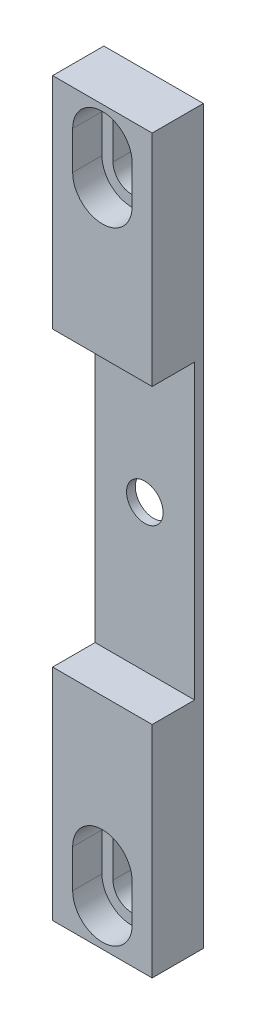
ISO-10303-21;
HEADER;
FILE_DESCRIPTION(('STEP AP214'),'2;1');
FILE_NAME('part.step','',(''),(''),'','','');
FILE_SCHEMA(('AUTOMOTIVE_DESIGN { 1 0 10303 214 1 1 1 1 }'));
ENDSEC;
DATA;
#1=APPLICATION_CONTEXT('core data for automotive mechanical design processes');
#2=APPLICATION_PROTOCOL_DEFINITION('international standard','automotive_design',2000,#1);
#3=PRODUCT_CONTEXT('',#1,'mechanical');
#4=PRODUCT('Part','Part','',(#3));
#5=PRODUCT_RELATED_PRODUCT_CATEGORY('part','',(#4));
#6=PRODUCT_DEFINITION_FORMATION('','',#4);
#7=PRODUCT_DEFINITION_CONTEXT('part definition',#1,'design');
#8=PRODUCT_DEFINITION('design','',#6,#7);
#9=PRODUCT_DEFINITION_SHAPE('','',#8);
#10=(LENGTH_UNIT() NAMED_UNIT(*) SI_UNIT(.MILLI.,.METRE.));
#11=(NAMED_UNIT(*) PLANE_ANGLE_UNIT() SI_UNIT($,.RADIAN.));
#12=(NAMED_UNIT(*) SI_UNIT($,.STERADIAN.) SOLID_ANGLE_UNIT());
#13=UNCERTAINTY_MEASURE_WITH_UNIT(LENGTH_MEASURE(1.E-05),#10,'distance_accuracy_value','');
#14=(GEOMETRIC_REPRESENTATION_CONTEXT(3) GLOBAL_UNCERTAINTY_ASSIGNED_CONTEXT((#13)) GLOBAL_UNIT_ASSIGNED_CONTEXT((#10,
#11,#12)) REPRESENTATION_CONTEXT('',''));
#15=CARTESIAN_POINT('',(0.,0.,0.));
#16=DIRECTION('',(0.,0.,1.));
#17=DIRECTION('',(1.,0.,0.));
#18=AXIS2_PLACEMENT_3D('',#15,#16,#17);
#19=CARTESIAN_POINT('',(0.,-57.277,0.));
#20=DIRECTION('',(0.,0.,1.));
#21=DIRECTION('',(1.,0.,0.));
#22=AXIS2_PLACEMENT_3D('',#19,#20,#21);
#23=CYLINDRICAL_SURFACE('',#22,3.2385);
#24=CARTESIAN_POINT('',(0.,-57.277,3.81));
#25=DIRECTION('',(0.,0.,1.));
#26=DIRECTION('',(1.,0.,0.));
#27=AXIS2_PLACEMENT_3D('',#24,#25,#26);
#28=CIRCLE('',#27,3.2385);
#29=CARTESIAN_POINT('',(3.2385,-57.277,3.81));
#30=VERTEX_POINT('',#29);
#31=CARTESIAN_POINT('',(-3.2385,-57.277,3.81));
#32=VERTEX_POINT('',#31);
#33=EDGE_CURVE('E250',#30,#32,#28,.F.);
#34=ORIENTED_EDGE('',*,*,#33,.F.);
#35=DIRECTION('',(0.,0.,1.));
#36=VECTOR('',#35,1.);
#37=CARTESIAN_POINT('',(3.2385,-57.277,0.));
#38=LINE('',#37,#36);
#39=CARTESIAN_POINT('',(3.2385,-57.277,0.));
#40=VERTEX_POINT('',#39);
#41=EDGE_CURVE('E302',#40,#30,#38,.T.);
#42=ORIENTED_EDGE('',*,*,#41,.F.);
#43=CARTESIAN_POINT('',(0.,-57.277,0.));
#44=DIRECTION('',(0.,0.,1.));
#45=DIRECTION('',(-1.,0.,0.));
#46=AXIS2_PLACEMENT_3D('',#43,#44,#45);
#47=CIRCLE('',#46,3.2385);
#48=CARTESIAN_POINT('',(-3.2385,-57.277,0.));
#49=VERTEX_POINT('',#48);
#50=EDGE_CURVE('E290',#49,#40,#47,.T.);
#51=ORIENTED_EDGE('',*,*,#50,.F.);
#52=DIRECTION('',(0.,0.,1.));
#53=VECTOR('',#52,1.);
#54=CARTESIAN_POINT('',(-3.2385,-57.277,0.));
#55=LINE('',#54,#53);
#56=EDGE_CURVE('E303',#49,#32,#55,.T.);
#57=ORIENTED_EDGE('',*,*,#56,.T.);
#58=EDGE_LOOP('',(#34,#42,#51,#57));
#59=FACE_BOUND('',#58,.T.);
#60=ADVANCED_FACE('F49',(#59),#23,.F.);
#61=CARTESIAN_POINT('',(-3.2385,-57.277,0.));
#62=DIRECTION('',(-1.,0.,0.));
#63=DIRECTION('',(0.,0.,1.));
#64=AXIS2_PLACEMENT_3D('',#61,#62,#63);
#65=PLANE('',#64);
#66=DIRECTION('',(0.,1.,0.));
#67=VECTOR('',#66,1.);
#68=CARTESIAN_POINT('',(-3.2385,-57.277,3.81));
#69=LINE('',#68,#67);
#70=CARTESIAN_POINT('',(-3.2385,-50.673,3.81));
#71=VERTEX_POINT('',#70);
#72=EDGE_CURVE('E248',#32,#71,#69,.T.);
#73=ORIENTED_EDGE('',*,*,#72,.F.);
#74=ORIENTED_EDGE('',*,*,#56,.F.);
#75=DIRECTION('',(0.,-1.,0.));
#76=VECTOR('',#75,1.);
#77=CARTESIAN_POINT('',(-3.2385,-57.277,0.));
#78=LINE('',#77,#76);
#79=CARTESIAN_POINT('',(-3.2385,-50.673,0.));
#80=VERTEX_POINT('',#79);
#81=EDGE_CURVE('E299',#80,#49,#78,.T.);
#82=ORIENTED_EDGE('',*,*,#81,.F.);
#83=DIRECTION('',(0.,0.,1.));
#84=VECTOR('',#83,1.);
#85=CARTESIAN_POINT('',(-3.2385,-50.673,0.));
#86=LINE('',#85,#84);
#87=EDGE_CURVE('E307',#80,#71,#86,.T.);
#88=ORIENTED_EDGE('',*,*,#87,.T.);
#89=EDGE_LOOP('',(#73,#74,#82,#88));
#90=FACE_BOUND('',#89,.T.);
#91=ADVANCED_FACE('F432',(#90),#65,.F.);
#92=CARTESIAN_POINT('',(0.,-50.673,0.));
#93=DIRECTION('',(0.,0.,1.));
#94=DIRECTION('',(1.,0.,0.));
#95=AXIS2_PLACEMENT_3D('',#92,#93,#94);
#96=CYLINDRICAL_SURFACE('',#95,3.2385);
#97=CARTESIAN_POINT('',(0.,-50.673,3.81));
#98=DIRECTION('',(0.,0.,1.));
#99=DIRECTION('',(1.,0.,0.));
#100=AXIS2_PLACEMENT_3D('',#97,#98,#99);
#101=CIRCLE('',#100,3.2385);
#102=CARTESIAN_POINT('',(3.2385,-50.673,3.81));
#103=VERTEX_POINT('',#102);
#104=EDGE_CURVE('E71',#71,#103,#101,.F.);
#105=ORIENTED_EDGE('',*,*,#104,.F.);
#106=ORIENTED_EDGE('',*,*,#87,.F.);
#107=CARTESIAN_POINT('',(0.,-50.673,0.));
#108=DIRECTION('',(0.,0.,1.));
#109=DIRECTION('',(-1.,0.,0.));
#110=AXIS2_PLACEMENT_3D('',#107,#108,#109);
#111=CIRCLE('',#110,3.2385);
#112=CARTESIAN_POINT('',(3.2385,-50.673,0.));
#113=VERTEX_POINT('',#112);
#114=EDGE_CURVE('E296',#113,#80,#111,.T.);
#115=ORIENTED_EDGE('',*,*,#114,.F.);
#116=DIRECTION('',(0.,0.,1.));
#117=VECTOR('',#116,1.);
#118=CARTESIAN_POINT('',(3.2385,-50.673,0.));
#119=LINE('',#118,#117);
#120=EDGE_CURVE('E310',#113,#103,#119,.T.);
#121=ORIENTED_EDGE('',*,*,#120,.T.);
#122=EDGE_LOOP('',(#105,#106,#115,#121));
#123=FACE_BOUND('',#122,.T.);
#124=ADVANCED_FACE('F438',(#123),#96,.F.);
#125=CARTESIAN_POINT('',(3.2385,-57.277,0.));
#126=DIRECTION('',(1.,0.,0.));
#127=DIRECTION('',(0.,0.,-1.));
#128=AXIS2_PLACEMENT_3D('',#125,#126,#127);
#129=PLANE('',#128);
#130=DIRECTION('',(0.,-1.,0.));
#131=VECTOR('',#130,1.);
#132=CARTESIAN_POINT('',(3.2385,-57.277,3.81));
#133=LINE('',#132,#131);
#134=EDGE_CURVE('E13',#103,#30,#133,.T.);
#135=ORIENTED_EDGE('',*,*,#134,.F.);
#136=ORIENTED_EDGE('',*,*,#120,.F.);
#137=DIRECTION('',(0.,1.,0.));
#138=VECTOR('',#137,1.);
#139=CARTESIAN_POINT('',(3.2385,-57.277,0.));
#140=LINE('',#139,#138);
#141=EDGE_CURVE('E293',#40,#113,#140,.T.);
#142=ORIENTED_EDGE('',*,*,#141,.F.);
#143=ORIENTED_EDGE('',*,*,#41,.T.);
#144=EDGE_LOOP('',(#135,#136,#142,#143));
#145=FACE_BOUND('',#144,.T.);
#146=ADVANCED_FACE('F443',(#145),#129,.F.);
#147=CARTESIAN_POINT('',(0.,57.277,0.));
#148=DIRECTION('',(0.,0.,1.));
#149=DIRECTION('',(1.,0.,0.));
#150=AXIS2_PLACEMENT_3D('',#147,#148,#149);
#151=CYLINDRICAL_SURFACE('',#150,3.23850000000001);
#152=CARTESIAN_POINT('',(0.,57.277,3.81));
#153=DIRECTION('',(0.,0.,1.));
#154=DIRECTION('',(1.,0.,0.));
#155=AXIS2_PLACEMENT_3D('',#152,#153,#154);
#156=CIRCLE('',#155,3.23850000000001);
#157=CARTESIAN_POINT('',(-3.23850000000001,57.277,3.81));
#158=VERTEX_POINT('',#157);
#159=CARTESIAN_POINT('',(3.2385,57.277,3.81));
#160=VERTEX_POINT('',#159);
#161=EDGE_CURVE('E288',#158,#160,#156,.F.);
#162=ORIENTED_EDGE('',*,*,#161,.F.);
#163=DIRECTION('',(0.,0.,1.));
#164=VECTOR('',#163,1.);
#165=CARTESIAN_POINT('',(-3.23850000000001,57.277,0.));
#166=LINE('',#165,#164);
#167=CARTESIAN_POINT('',(-3.23850000000001,57.277,0.));
#168=VERTEX_POINT('',#167);
#169=EDGE_CURVE('E326',#168,#158,#166,.T.);
#170=ORIENTED_EDGE('',*,*,#169,.F.);
#171=CARTESIAN_POINT('',(0.,57.277,0.));
#172=DIRECTION('',(0.,0.,1.));
#173=DIRECTION('',(1.,0.,0.));
#174=AXIS2_PLACEMENT_3D('',#171,#172,#173);
#175=CIRCLE('',#174,3.23850000000001);
#176=CARTESIAN_POINT('',(3.2385,57.277,0.));
#177=VERTEX_POINT('',#176);
#178=EDGE_CURVE('E306',#177,#168,#175,.T.);
#179=ORIENTED_EDGE('',*,*,#178,.F.);
#180=DIRECTION('',(0.,0.,1.));
#181=VECTOR('',#180,1.);
#182=CARTESIAN_POINT('',(3.2385,57.277,0.));
#183=LINE('',#182,#181);
#184=EDGE_CURVE('E327',#177,#160,#183,.T.);
#185=ORIENTED_EDGE('',*,*,#184,.T.);
#186=EDGE_LOOP('',(#162,#170,#179,#185));
#187=FACE_BOUND('',#186,.T.);
#188=ADVANCED_FACE('F410',(#187),#151,.F.);
#189=CARTESIAN_POINT('',(3.2385,57.277,0.));
#190=DIRECTION('',(1.,0.,0.));
#191=DIRECTION('',(0.,0.,-1.));
#192=AXIS2_PLACEMENT_3D('',#189,#190,#191);
#193=PLANE('',#192);
#194=DIRECTION('',(0.,-1.,0.));
#195=VECTOR('',#194,1.);
#196=CARTESIAN_POINT('',(3.2385,57.277,3.81));
#197=LINE('',#196,#195);
#198=CARTESIAN_POINT('',(3.23850000000001,50.673,3.81));
#199=VERTEX_POINT('',#198);
#200=EDGE_CURVE('E286',#160,#199,#197,.T.);
#201=ORIENTED_EDGE('',*,*,#200,.F.);
#202=ORIENTED_EDGE('',*,*,#184,.F.);
#203=DIRECTION('',(0.,1.,0.));
#204=VECTOR('',#203,1.);
#205=CARTESIAN_POINT('',(3.2385,57.277,0.));
#206=LINE('',#205,#204);
#207=CARTESIAN_POINT('',(3.2385,50.673,0.));
#208=VERTEX_POINT('',#207);
#209=EDGE_CURVE('E323',#208,#177,#206,.T.);
#210=ORIENTED_EDGE('',*,*,#209,.F.);
#211=DIRECTION('',(0.,0.,1.));
#212=VECTOR('',#211,1.);
#213=CARTESIAN_POINT('',(3.2385,50.673,0.));
#214=LINE('',#213,#212);
#215=EDGE_CURVE('E331',#208,#199,#214,.T.);
#216=ORIENTED_EDGE('',*,*,#215,.T.);
#217=EDGE_LOOP('',(#201,#202,#210,#216));
#218=FACE_BOUND('',#217,.T.);
#219=ADVANCED_FACE('F419',(#218),#193,.F.);
#220=CARTESIAN_POINT('',(0.,50.673,0.));
#221=DIRECTION('',(0.,0.,1.));
#222=DIRECTION('',(1.,0.,0.));
#223=AXIS2_PLACEMENT_3D('',#220,#221,#222);
#224=CYLINDRICAL_SURFACE('',#223,3.23850000000001);
#225=CARTESIAN_POINT('',(0.,50.673,3.81));
#226=DIRECTION('',(0.,0.,1.));
#227=DIRECTION('',(1.,0.,0.));
#228=AXIS2_PLACEMENT_3D('',#225,#226,#227);
#229=CIRCLE('',#228,3.23850000000001);
#230=CARTESIAN_POINT('',(-3.23850000000001,50.673,3.81));
#231=VERTEX_POINT('',#230);
#232=EDGE_CURVE('E278',#199,#231,#229,.F.);
#233=ORIENTED_EDGE('',*,*,#232,.F.);
#234=ORIENTED_EDGE('',*,*,#215,.F.);
#235=CARTESIAN_POINT('',(0.,50.673,0.));
#236=DIRECTION('',(0.,0.,1.));
#237=DIRECTION('',(1.,0.,0.));
#238=AXIS2_PLACEMENT_3D('',#235,#236,#237);
#239=CIRCLE('',#238,3.23850000000001);
#240=CARTESIAN_POINT('',(-3.23850000000001,50.673,0.));
#241=VERTEX_POINT('',#240);
#242=EDGE_CURVE('E320',#241,#208,#239,.T.);
#243=ORIENTED_EDGE('',*,*,#242,.F.);
#244=DIRECTION('',(0.,0.,1.));
#245=VECTOR('',#244,1.);
#246=CARTESIAN_POINT('',(-3.23850000000001,50.673,0.));
#247=LINE('',#246,#245);
#248=EDGE_CURVE('E334',#241,#231,#247,.T.);
#249=ORIENTED_EDGE('',*,*,#248,.T.);
#250=EDGE_LOOP('',(#233,#234,#243,#249));
#251=FACE_BOUND('',#250,.T.);
#252=ADVANCED_FACE('F421',(#251),#224,.F.);
#253=CARTESIAN_POINT('',(-3.23850000000001,57.277,0.));
#254=DIRECTION('',(-1.,0.,0.));
#255=DIRECTION('',(0.,-1.,0.));
#256=AXIS2_PLACEMENT_3D('',#253,#254,#255);
#257=PLANE('',#256);
#258=DIRECTION('',(0.,1.,0.));
#259=VECTOR('',#258,1.);
#260=CARTESIAN_POINT('',(-3.23850000000001,57.277,3.81));
#261=LINE('',#260,#259);
#262=EDGE_CURVE('E57',#231,#158,#261,.T.);
#263=ORIENTED_EDGE('',*,*,#262,.F.);
#264=ORIENTED_EDGE('',*,*,#248,.F.);
#265=DIRECTION('',(0.,-1.,0.));
#266=VECTOR('',#265,1.);
#267=CARTESIAN_POINT('',(-3.23850000000001,57.277,0.));
#268=LINE('',#267,#266);
#269=EDGE_CURVE('E317',#168,#241,#268,.T.);
#270=ORIENTED_EDGE('',*,*,#269,.F.);
#271=ORIENTED_EDGE('',*,*,#169,.T.);
#272=EDGE_LOOP('',(#263,#264,#270,#271));
#273=FACE_BOUND('',#272,.T.);
#274=ADVANCED_FACE('F413',(#273),#257,.F.);
#275=CARTESIAN_POINT('',(0.,0.,8.89));
#276=DIRECTION('',(0.,0.,-1.));
#277=DIRECTION('',(-1.,0.,0.));
#278=AXIS2_PLACEMENT_3D('',#275,#276,#277);
#279=PLANE('',#278);
#280=DIRECTION('',(0.,1.,0.));
#281=VECTOR('',#280,1.);
#282=CARTESIAN_POINT('',(5.159375,50.673,8.89));
#283=LINE('',#282,#281);
#284=CARTESIAN_POINT('',(5.159375,50.673,8.89));
#285=VERTEX_POINT('',#284);
#286=CARTESIAN_POINT('',(5.15937499999999,57.277,8.89));
#287=VERTEX_POINT('',#286);
#288=EDGE_CURVE('E268',#285,#287,#283,.T.);
#289=ORIENTED_EDGE('',*,*,#288,.F.);
#290=CARTESIAN_POINT('',(0.,50.673,8.89));
#291=DIRECTION('',(0.,0.,1.));
#292=DIRECTION('',(1.,0.,0.));
#293=AXIS2_PLACEMENT_3D('',#290,#291,#292);
#294=CIRCLE('',#293,5.159375);
#295=CARTESIAN_POINT('',(-5.159375,50.673,8.89));
#296=VERTEX_POINT('',#295);
#297=EDGE_CURVE('E252',#296,#285,#294,.T.);
#298=ORIENTED_EDGE('',*,*,#297,.F.);
#299=DIRECTION('',(0.,-1.,0.));
#300=VECTOR('',#299,1.);
#301=CARTESIAN_POINT('',(-5.159375,50.673,8.89));
#302=LINE('',#301,#300);
#303=CARTESIAN_POINT('',(-5.159375,57.277,8.89));
#304=VERTEX_POINT('',#303);
#305=EDGE_CURVE('E257',#304,#296,#302,.T.);
#306=ORIENTED_EDGE('',*,*,#305,.F.);
#307=CARTESIAN_POINT('',(0.,57.277,8.89));
#308=DIRECTION('',(0.,0.,1.));
#309=DIRECTION('',(1.,0.,0.));
#310=AXIS2_PLACEMENT_3D('',#307,#308,#309);
#311=CIRCLE('',#310,5.159375);
#312=EDGE_CURVE('E271',#287,#304,#311,.T.);
#313=ORIENTED_EDGE('',*,*,#312,.F.);
#314=EDGE_LOOP('',(#289,#298,#306,#313));
#315=FACE_BOUND('',#314,.T.);
#316=DIRECTION('',(0.,-1.,0.));
#317=VECTOR('',#316,1.);
#318=CARTESIAN_POINT('',(-8.636,-63.5,8.89));
#319=LINE('',#318,#317);
#320=CARTESIAN_POINT('',(-8.636,63.5,8.89));
#321=VERTEX_POINT('',#320);
#322=CARTESIAN_POINT('',(-8.636,25.4,8.89));
#323=VERTEX_POINT('',#322);
#324=EDGE_CURVE('E368',#321,#323,#319,.T.);
#325=ORIENTED_EDGE('',*,*,#324,.T.);
#326=DIRECTION('',(-1.,0.,0.));
#327=VECTOR('',#326,1.);
#328=CARTESIAN_POINT('',(-8.636,25.4,8.89));
#329=LINE('',#328,#327);
#330=CARTESIAN_POINT('',(8.636,25.4,8.89));
#331=VERTEX_POINT('',#330);
#332=EDGE_CURVE('E343',#331,#323,#329,.T.);
#333=ORIENTED_EDGE('',*,*,#332,.F.);
#334=DIRECTION('',(0.,1.,0.));
#335=VECTOR('',#334,1.);
#336=CARTESIAN_POINT('',(8.636,-63.5,8.89));
#337=LINE('',#336,#335);
#338=CARTESIAN_POINT('',(8.636,63.5,8.89));
#339=VERTEX_POINT('',#338);
#340=EDGE_CURVE('E374',#331,#339,#337,.T.);
#341=ORIENTED_EDGE('',*,*,#340,.T.);
#342=DIRECTION('',(-1.,0.,0.));
#343=VECTOR('',#342,1.);
#344=CARTESIAN_POINT('',(-8.636,63.5,8.89));
#345=LINE('',#344,#343);
#346=EDGE_CURVE('E378',#339,#321,#345,.T.);
#347=ORIENTED_EDGE('',*,*,#346,.T.);
#348=EDGE_LOOP('',(#325,#333,#341,#347));
#349=FACE_BOUND('',#348,.T.);
#350=ADVANCED_FACE('F428',(#315,#349),#279,.F.);
#351=CARTESIAN_POINT('',(0.,0.,8.89));
#352=DIRECTION('',(0.,0.,1.));
#353=DIRECTION('',(1.,0.,0.));
#354=AXIS2_PLACEMENT_3D('',#351,#352,#353);
#355=CYLINDRICAL_SURFACE('',#354,3.175);
#356=CARTESIAN_POINT('',(0.,0.,0.));
#357=DIRECTION('',(0.,0.,-1.));
#358=DIRECTION('',(-1.,0.,0.));
#359=AXIS2_PLACEMENT_3D('',#356,#357,#358);
#360=CIRCLE('',#359,3.175);
#361=CARTESIAN_POINT('',(-3.175,0.,0.));
#362=VERTEX_POINT('',#361);
#363=EDGE_CURVE('E364',#362,#362,#360,.T.);
#364=ORIENTED_EDGE('',*,*,#363,.T.);
#365=EDGE_LOOP('',(#364));
#366=FACE_BOUND('',#365,.T.);
#367=CARTESIAN_POINT('',(0.,0.,1.524));
#368=DIRECTION('',(0.,0.,1.));
#369=DIRECTION('',(1.,0.,0.));
#370=AXIS2_PLACEMENT_3D('',#367,#368,#369);
#371=CIRCLE('',#370,3.175);
#372=CARTESIAN_POINT('',(3.175,0.,1.524));
#373=VERTEX_POINT('',#372);
#374=EDGE_CURVE('E357',#373,#373,#371,.F.);
#375=ORIENTED_EDGE('',*,*,#374,.F.);
#376=EDGE_LOOP('',(#375));
#377=FACE_BOUND('',#376,.T.);
#378=ADVANCED_FACE('F614',(#366,#377),#355,.F.);
#379=CARTESIAN_POINT('',(-8.636,-63.5,8.89));
#380=DIRECTION('',(1.,0.,0.));
#381=DIRECTION('',(0.,0.,-1.));
#382=AXIS2_PLACEMENT_3D('',#379,#380,#381);
#383=PLANE('',#382);
#384=DIRECTION('',(0.,-1.,0.));
#385=VECTOR('',#384,1.);
#386=CARTESIAN_POINT('',(-8.636,25.4,1.524));
#387=LINE('',#386,#385);
#388=CARTESIAN_POINT('',(-8.636,25.4,1.524));
#389=VERTEX_POINT('',#388);
#390=CARTESIAN_POINT('',(-8.63599999999999,-25.4,1.524));
#391=VERTEX_POINT('',#390);
#392=EDGE_CURVE('E339',#389,#391,#387,.T.);
#393=ORIENTED_EDGE('',*,*,#392,.F.);
#394=DIRECTION('',(0.,0.,1.));
#395=VECTOR('',#394,1.);
#396=CARTESIAN_POINT('',(-8.636,25.4,1.524));
#397=LINE('',#396,#395);
#398=EDGE_CURVE('E354',#389,#323,#397,.T.);
#399=ORIENTED_EDGE('',*,*,#398,.T.);
#400=ORIENTED_EDGE('',*,*,#324,.F.);
#401=DIRECTION('',(0.,0.,-1.));
#402=VECTOR('',#401,1.);
#403=CARTESIAN_POINT('',(-8.636,63.5,8.89));
#404=LINE('',#403,#402);
#405=CARTESIAN_POINT('',(-8.636,63.5,0.));
#406=VERTEX_POINT('',#405);
#407=EDGE_CURVE('E380',#321,#406,#404,.T.);
#408=ORIENTED_EDGE('',*,*,#407,.T.);
#409=DIRECTION('',(0.,-1.,0.));
#410=VECTOR('',#409,1.);
#411=CARTESIAN_POINT('',(-8.636,-63.5,0.));
#412=LINE('',#411,#410);
#413=CARTESIAN_POINT('',(-8.636,-63.5,0.));
#414=VERTEX_POINT('',#413);
#415=EDGE_CURVE('E367',#406,#414,#412,.T.);
#416=ORIENTED_EDGE('',*,*,#415,.T.);
#417=DIRECTION('',(0.,0.,-1.));
#418=VECTOR('',#417,1.);
#419=CARTESIAN_POINT('',(-8.636,-63.5,8.89));
#420=LINE('',#419,#418);
#421=CARTESIAN_POINT('',(-8.636,-63.5,8.89));
#422=VERTEX_POINT('',#421);
#423=EDGE_CURVE('E397',#422,#414,#420,.T.);
#424=ORIENTED_EDGE('',*,*,#423,.F.);
#425=CARTESIAN_POINT('',(-8.636,-25.4,8.89));
#426=VERTEX_POINT('',#425);
#427=EDGE_CURVE('E372',#426,#422,#319,.T.);
#428=ORIENTED_EDGE('',*,*,#427,.F.);
#429=DIRECTION('',(0.,0.,1.));
#430=VECTOR('',#429,1.);
#431=CARTESIAN_POINT('',(-8.63599999999999,-25.4,1.524));
#432=LINE('',#431,#430);
#433=EDGE_CURVE('E351',#391,#426,#432,.T.);
#434=ORIENTED_EDGE('',*,*,#433,.F.);
#435=EDGE_LOOP('',(#393,#399,#400,#408,#416,#424,#428,#434));
#436=FACE_BOUND('',#435,.T.);
#437=ADVANCED_FACE('F51',(#436),#383,.F.);
#438=CARTESIAN_POINT('',(-8.636,-63.5,8.89));
#439=DIRECTION('',(0.,1.,0.));
#440=DIRECTION('',(0.,0.,1.));
#441=AXIS2_PLACEMENT_3D('',#438,#439,#440);
#442=PLANE('',#441);
#443=DIRECTION('',(1.,0.,0.));
#444=VECTOR('',#443,1.);
#445=CARTESIAN_POINT('',(-8.636,-63.5,0.));
#446=LINE('',#445,#444);
#447=CARTESIAN_POINT('',(8.636,-63.5,0.));
#448=VERTEX_POINT('',#447);
#449=EDGE_CURVE('E383',#414,#448,#446,.T.);
#450=ORIENTED_EDGE('',*,*,#449,.T.);
#451=DIRECTION('',(0.,0.,-1.));
#452=VECTOR('',#451,1.);
#453=CARTESIAN_POINT('',(8.636,-63.5,8.89));
#454=LINE('',#453,#452);
#455=CARTESIAN_POINT('',(8.636,-63.5,8.89));
#456=VERTEX_POINT('',#455);
#457=EDGE_CURVE('E394',#456,#448,#454,.T.);
#458=ORIENTED_EDGE('',*,*,#457,.F.);
#459=DIRECTION('',(1.,0.,0.));
#460=VECTOR('',#459,1.);
#461=CARTESIAN_POINT('',(-8.636,-63.5,8.89));
#462=LINE('',#461,#460);
#463=EDGE_CURVE('E371',#422,#456,#462,.T.);
#464=ORIENTED_EDGE('',*,*,#463,.F.);
#465=ORIENTED_EDGE('',*,*,#423,.T.);
#466=EDGE_LOOP('',(#450,#458,#464,#465));
#467=FACE_BOUND('',#466,.T.);
#468=ADVANCED_FACE('F656',(#467),#442,.F.);
#469=CARTESIAN_POINT('',(8.636,-63.5,8.89));
#470=DIRECTION('',(-1.,0.,0.));
#471=DIRECTION('',(0.,0.,1.));
#472=AXIS2_PLACEMENT_3D('',#469,#470,#471);
#473=PLANE('',#472);
#474=ORIENTED_EDGE('',*,*,#340,.F.);
#475=DIRECTION('',(0.,0.,1.));
#476=VECTOR('',#475,1.);
#477=CARTESIAN_POINT('',(8.636,25.4,1.524));
#478=LINE('',#477,#476);
#479=CARTESIAN_POINT('',(8.636,25.4,1.524));
#480=VERTEX_POINT('',#479);
#481=EDGE_CURVE('E358',#480,#331,#478,.T.);
#482=ORIENTED_EDGE('',*,*,#481,.F.);
#483=DIRECTION('',(0.,1.,0.));
#484=VECTOR('',#483,1.);
#485=CARTESIAN_POINT('',(8.636,25.4,1.524));
#486=LINE('',#485,#484);
#487=CARTESIAN_POINT('',(8.636,-25.4,1.524));
#488=VERTEX_POINT('',#487);
#489=EDGE_CURVE('E346',#488,#480,#486,.T.);
#490=ORIENTED_EDGE('',*,*,#489,.F.);
#491=DIRECTION('',(0.,0.,1.));
#492=VECTOR('',#491,1.);
#493=CARTESIAN_POINT('',(8.636,-25.4,1.524));
#494=LINE('',#493,#492);
#495=CARTESIAN_POINT('',(8.636,-25.4,8.89));
#496=VERTEX_POINT('',#495);
#497=EDGE_CURVE('E360',#488,#496,#494,.T.);
#498=ORIENTED_EDGE('',*,*,#497,.T.);
#499=EDGE_CURVE('E375',#456,#496,#337,.T.);
#500=ORIENTED_EDGE('',*,*,#499,.F.);
#501=ORIENTED_EDGE('',*,*,#457,.T.);
#502=DIRECTION('',(0.,1.,0.));
#503=VECTOR('',#502,1.);
#504=CARTESIAN_POINT('',(8.636,-63.5,0.));
#505=LINE('',#504,#503);
#506=CARTESIAN_POINT('',(8.636,63.5,0.));
#507=VERTEX_POINT('',#506);
#508=EDGE_CURVE('E385',#448,#507,#505,.T.);
#509=ORIENTED_EDGE('',*,*,#508,.T.);
#510=DIRECTION('',(0.,0.,-1.));
#511=VECTOR('',#510,1.);
#512=CARTESIAN_POINT('',(8.636,63.5,8.89));
#513=LINE('',#512,#511);
#514=EDGE_CURVE('E391',#339,#507,#513,.T.);
#515=ORIENTED_EDGE('',*,*,#514,.F.);
#516=EDGE_LOOP('',(#474,#482,#490,#498,#500,#501,#509,#515));
#517=FACE_BOUND('',#516,.T.);
#518=ADVANCED_FACE('F647',(#517),#473,.F.);
#519=CARTESIAN_POINT('',(-8.636,63.5,8.89));
#520=DIRECTION('',(0.,-1.,0.));
#521=DIRECTION('',(0.,0.,-1.));
#522=AXIS2_PLACEMENT_3D('',#519,#520,#521);
#523=PLANE('',#522);
#524=DIRECTION('',(-1.,0.,0.));
#525=VECTOR('',#524,1.);
#526=CARTESIAN_POINT('',(-8.636,63.5,0.));
#527=LINE('',#526,#525);
#528=EDGE_CURVE('E387',#507,#406,#527,.T.);
#529=ORIENTED_EDGE('',*,*,#528,.T.);
#530=ORIENTED_EDGE('',*,*,#407,.F.);
#531=ORIENTED_EDGE('',*,*,#346,.F.);
#532=ORIENTED_EDGE('',*,*,#514,.T.);
#533=EDGE_LOOP('',(#529,#530,#531,#532));
#534=FACE_BOUND('',#533,.T.);
#535=ADVANCED_FACE('F640',(#534),#523,.F.);
#536=DIRECTION('',(0.,-1.,0.));
#537=VECTOR('',#536,1.);
#538=CARTESIAN_POINT('',(-5.15937499999999,-50.673,8.89));
#539=LINE('',#538,#537);
#540=CARTESIAN_POINT('',(-5.15937499999999,-50.673,8.89));
#541=VERTEX_POINT('',#540);
#542=CARTESIAN_POINT('',(-5.15937499999998,-57.277,8.89));
#543=VERTEX_POINT('',#542);
#544=EDGE_CURVE('E238',#541,#543,#539,.T.);
#545=ORIENTED_EDGE('',*,*,#544,.F.);
#546=CARTESIAN_POINT('',(0.,-50.673,8.89));
#547=DIRECTION('',(0.,0.,1.));
#548=DIRECTION('',(1.,0.,0.));
#549=AXIS2_PLACEMENT_3D('',#546,#547,#548);
#550=CIRCLE('',#549,5.15937499999999);
#551=CARTESIAN_POINT('',(5.15937499999999,-50.673,8.89));
#552=VERTEX_POINT('',#551);
#553=EDGE_CURVE('E64',#552,#541,#550,.T.);
#554=ORIENTED_EDGE('',*,*,#553,.F.);
#555=DIRECTION('',(0.,1.,0.));
#556=VECTOR('',#555,1.);
#557=CARTESIAN_POINT('',(5.15937499999999,-50.673,8.89));
#558=LINE('',#557,#556);
#559=CARTESIAN_POINT('',(5.15937499999999,-57.277,8.89));
#560=VERTEX_POINT('',#559);
#561=EDGE_CURVE('E229',#560,#552,#558,.T.);
#562=ORIENTED_EDGE('',*,*,#561,.F.);
#563=CARTESIAN_POINT('',(0.,-57.277,8.89));
#564=DIRECTION('',(0.,0.,1.));
#565=DIRECTION('',(1.,0.,0.));
#566=AXIS2_PLACEMENT_3D('',#563,#564,#565);
#567=CIRCLE('',#566,5.15937499999999);
#568=EDGE_CURVE('E232',#543,#560,#567,.T.);
#569=ORIENTED_EDGE('',*,*,#568,.F.);
#570=EDGE_LOOP('',(#545,#554,#562,#569));
#571=FACE_BOUND('',#570,.T.);
#572=ORIENTED_EDGE('',*,*,#499,.T.);
#573=DIRECTION('',(1.,0.,0.));
#574=VECTOR('',#573,1.);
#575=CARTESIAN_POINT('',(-8.63599999999999,-25.4,8.89));
#576=LINE('',#575,#574);
#577=EDGE_CURVE('E330',#426,#496,#576,.T.);
#578=ORIENTED_EDGE('',*,*,#577,.F.);
#579=ORIENTED_EDGE('',*,*,#427,.T.);
#580=ORIENTED_EDGE('',*,*,#463,.T.);
#581=EDGE_LOOP('',(#572,#578,#579,#580));
#582=FACE_BOUND('',#581,.T.);
#583=ADVANCED_FACE('F617',(#571,#582),#279,.F.);
#584=CARTESIAN_POINT('',(0.,0.,0.));
#585=DIRECTION('',(0.,0.,-1.));
#586=DIRECTION('',(-1.,0.,0.));
#587=AXIS2_PLACEMENT_3D('',#584,#585,#586);
#588=PLANE('',#587);
#589=ORIENTED_EDGE('',*,*,#50,.T.);
#590=ORIENTED_EDGE('',*,*,#141,.T.);
#591=ORIENTED_EDGE('',*,*,#114,.T.);
#592=ORIENTED_EDGE('',*,*,#81,.T.);
#593=EDGE_LOOP('',(#589,#590,#591,#592));
#594=FACE_BOUND('',#593,.T.);
#595=ORIENTED_EDGE('',*,*,#178,.T.);
#596=ORIENTED_EDGE('',*,*,#269,.T.);
#597=ORIENTED_EDGE('',*,*,#242,.T.);
#598=ORIENTED_EDGE('',*,*,#209,.T.);
#599=EDGE_LOOP('',(#595,#596,#597,#598));
#600=FACE_BOUND('',#599,.T.);
#601=ORIENTED_EDGE('',*,*,#363,.F.);
#602=EDGE_LOOP('',(#601));
#603=FACE_BOUND('',#602,.T.);
#604=ORIENTED_EDGE('',*,*,#415,.F.);
#605=ORIENTED_EDGE('',*,*,#528,.F.);
#606=ORIENTED_EDGE('',*,*,#508,.F.);
#607=ORIENTED_EDGE('',*,*,#449,.F.);
#608=EDGE_LOOP('',(#604,#605,#606,#607));
#609=FACE_BOUND('',#608,.T.);
#610=ADVANCED_FACE('F415',(#594,#600,#603,#609),#588,.T.);
#611=CARTESIAN_POINT('',(0.,0.,1.524));
#612=DIRECTION('',(0.,0.,1.));
#613=DIRECTION('',(1.,0.,0.));
#614=AXIS2_PLACEMENT_3D('',#611,#612,#613);
#615=PLANE('',#614);
#616=ORIENTED_EDGE('',*,*,#392,.T.);
#617=DIRECTION('',(1.,0.,0.));
#618=VECTOR('',#617,1.);
#619=CARTESIAN_POINT('',(-8.63599999999999,-25.4,1.524));
#620=LINE('',#619,#618);
#621=EDGE_CURVE('E342',#391,#488,#620,.T.);
#622=ORIENTED_EDGE('',*,*,#621,.T.);
#623=ORIENTED_EDGE('',*,*,#489,.T.);
#624=DIRECTION('',(-1.,0.,0.));
#625=VECTOR('',#624,1.);
#626=CARTESIAN_POINT('',(-8.636,25.4,1.524));
#627=LINE('',#626,#625);
#628=EDGE_CURVE('E348',#480,#389,#627,.T.);
#629=ORIENTED_EDGE('',*,*,#628,.T.);
#630=EDGE_LOOP('',(#616,#622,#623,#629));
#631=FACE_BOUND('',#630,.T.);
#632=ORIENTED_EDGE('',*,*,#374,.T.);
#633=EDGE_LOOP('',(#632));
#634=FACE_BOUND('',#633,.T.);
#635=ADVANCED_FACE('F597',(#631,#634),#615,.T.);
#636=CARTESIAN_POINT('',(-8.636,25.4,1.524));
#637=DIRECTION('',(0.,1.,0.));
#638=DIRECTION('',(0.,0.,1.));
#639=AXIS2_PLACEMENT_3D('',#636,#637,#638);
#640=PLANE('',#639);
#641=ORIENTED_EDGE('',*,*,#332,.T.);
#642=ORIENTED_EDGE('',*,*,#398,.F.);
#643=ORIENTED_EDGE('',*,*,#628,.F.);
#644=ORIENTED_EDGE('',*,*,#481,.T.);
#645=EDGE_LOOP('',(#641,#642,#643,#644));
#646=FACE_BOUND('',#645,.T.);
#647=ADVANCED_FACE('F588',(#646),#640,.F.);
#648=CARTESIAN_POINT('',(-8.63599999999999,-25.4,1.524));
#649=DIRECTION('',(0.,-1.,0.));
#650=DIRECTION('',(0.,0.,-1.));
#651=AXIS2_PLACEMENT_3D('',#648,#649,#650);
#652=PLANE('',#651);
#653=ORIENTED_EDGE('',*,*,#577,.T.);
#654=ORIENTED_EDGE('',*,*,#497,.F.);
#655=ORIENTED_EDGE('',*,*,#621,.F.);
#656=ORIENTED_EDGE('',*,*,#433,.T.);
#657=EDGE_LOOP('',(#653,#654,#655,#656));
#658=FACE_BOUND('',#657,.T.);
#659=ADVANCED_FACE('F468',(#658),#652,.F.);
#660=CARTESIAN_POINT('',(0.,50.673,3.81));
#661=DIRECTION('',(0.,0.,1.));
#662=DIRECTION('',(1.,0.,0.));
#663=AXIS2_PLACEMENT_3D('',#660,#661,#662);
#664=PLANE('',#663);
#665=CARTESIAN_POINT('',(0.,50.673,3.81));
#666=DIRECTION('',(0.,0.,1.));
#667=DIRECTION('',(1.,0.,0.));
#668=AXIS2_PLACEMENT_3D('',#665,#666,#667);
#669=CIRCLE('',#668,5.159375);
#670=CARTESIAN_POINT('',(-5.159375,50.673,3.81));
#671=VERTEX_POINT('',#670);
#672=CARTESIAN_POINT('',(5.159375,50.673,3.81));
#673=VERTEX_POINT('',#672);
#674=EDGE_CURVE('E253',#671,#673,#669,.T.);
#675=ORIENTED_EDGE('',*,*,#674,.T.);
#676=DIRECTION('',(0.,1.,0.));
#677=VECTOR('',#676,1.);
#678=CARTESIAN_POINT('',(5.159375,50.673,3.81));
#679=LINE('',#678,#677);
#680=CARTESIAN_POINT('',(5.15937499999999,57.277,3.81));
#681=VERTEX_POINT('',#680);
#682=EDGE_CURVE('E256',#673,#681,#679,.T.);
#683=ORIENTED_EDGE('',*,*,#682,.T.);
#684=CARTESIAN_POINT('',(0.,57.277,3.81));
#685=DIRECTION('',(0.,0.,1.));
#686=DIRECTION('',(1.,0.,0.));
#687=AXIS2_PLACEMENT_3D('',#684,#685,#686);
#688=CIRCLE('',#687,5.159375);
#689=CARTESIAN_POINT('',(-5.159375,57.277,3.81));
#690=VERTEX_POINT('',#689);
#691=EDGE_CURVE('E260',#681,#690,#688,.T.);
#692=ORIENTED_EDGE('',*,*,#691,.T.);
#693=DIRECTION('',(0.,-1.,0.));
#694=VECTOR('',#693,1.);
#695=CARTESIAN_POINT('',(-5.159375,50.673,3.81));
#696=LINE('',#695,#694);
#697=EDGE_CURVE('E263',#690,#671,#696,.T.);
#698=ORIENTED_EDGE('',*,*,#697,.T.);
#699=EDGE_LOOP('',(#675,#683,#692,#698));
#700=FACE_BOUND('',#699,.T.);
#701=ORIENTED_EDGE('',*,*,#161,.T.);
#702=ORIENTED_EDGE('',*,*,#200,.T.);
#703=ORIENTED_EDGE('',*,*,#232,.T.);
#704=ORIENTED_EDGE('',*,*,#262,.T.);
#705=EDGE_LOOP('',(#701,#702,#703,#704));
#706=FACE_BOUND('',#705,.T.);
#707=ADVANCED_FACE('F404',(#700,#706),#664,.T.);
#708=CARTESIAN_POINT('',(0.,50.673,3.81));
#709=DIRECTION('',(0.,0.,1.));
#710=DIRECTION('',(1.,0.,0.));
#711=AXIS2_PLACEMENT_3D('',#708,#709,#710);
#712=CYLINDRICAL_SURFACE('',#711,5.159375);
#713=ORIENTED_EDGE('',*,*,#297,.T.);
#714=DIRECTION('',(0.,0.,1.));
#715=VECTOR('',#714,1.);
#716=CARTESIAN_POINT('',(5.159375,50.673,3.81));
#717=LINE('',#716,#715);
#718=EDGE_CURVE('E266',#673,#285,#717,.T.);
#719=ORIENTED_EDGE('',*,*,#718,.F.);
#720=ORIENTED_EDGE('',*,*,#674,.F.);
#721=DIRECTION('',(0.,0.,1.));
#722=VECTOR('',#721,1.);
#723=CARTESIAN_POINT('',(-5.159375,50.673,3.81));
#724=LINE('',#723,#722);
#725=EDGE_CURVE('E276',#671,#296,#724,.T.);
#726=ORIENTED_EDGE('',*,*,#725,.T.);
#727=EDGE_LOOP('',(#713,#719,#720,#726));
#728=FACE_BOUND('',#727,.T.);
#729=ADVANCED_FACE('F450',(#728),#712,.F.);
#730=CARTESIAN_POINT('',(-5.159375,50.673,3.81));
#731=DIRECTION('',(-1.,0.,0.));
#732=DIRECTION('',(0.,-1.,0.));
#733=AXIS2_PLACEMENT_3D('',#730,#731,#732);
#734=PLANE('',#733);
#735=ORIENTED_EDGE('',*,*,#305,.T.);
#736=ORIENTED_EDGE('',*,*,#725,.F.);
#737=ORIENTED_EDGE('',*,*,#697,.F.);
#738=DIRECTION('',(0.,0.,1.));
#739=VECTOR('',#738,1.);
#740=CARTESIAN_POINT('',(-5.159375,57.277,3.81));
#741=LINE('',#740,#739);
#742=EDGE_CURVE('E279',#690,#304,#741,.T.);
#743=ORIENTED_EDGE('',*,*,#742,.T.);
#744=EDGE_LOOP('',(#735,#736,#737,#743));
#745=FACE_BOUND('',#744,.T.);
#746=ADVANCED_FACE('F453',(#745),#734,.F.);
#747=CARTESIAN_POINT('',(0.,57.277,3.81));
#748=DIRECTION('',(0.,0.,1.));
#749=DIRECTION('',(1.,0.,0.));
#750=AXIS2_PLACEMENT_3D('',#747,#748,#749);
#751=CYLINDRICAL_SURFACE('',#750,5.159375);
#752=ORIENTED_EDGE('',*,*,#312,.T.);
#753=ORIENTED_EDGE('',*,*,#742,.F.);
#754=ORIENTED_EDGE('',*,*,#691,.F.);
#755=DIRECTION('',(0.,0.,1.));
#756=VECTOR('',#755,1.);
#757=CARTESIAN_POINT('',(5.15937499999999,57.277,3.81));
#758=LINE('',#757,#756);
#759=EDGE_CURVE('E281',#681,#287,#758,.T.);
#760=ORIENTED_EDGE('',*,*,#759,.T.);
#761=EDGE_LOOP('',(#752,#753,#754,#760));
#762=FACE_BOUND('',#761,.T.);
#763=ADVANCED_FACE('F458',(#762),#751,.F.);
#764=CARTESIAN_POINT('',(5.159375,50.673,3.81));
#765=DIRECTION('',(1.,0.,0.));
#766=DIRECTION('',(0.,1.,0.));
#767=AXIS2_PLACEMENT_3D('',#764,#765,#766);
#768=PLANE('',#767);
#769=ORIENTED_EDGE('',*,*,#288,.T.);
#770=ORIENTED_EDGE('',*,*,#759,.F.);
#771=ORIENTED_EDGE('',*,*,#682,.F.);
#772=ORIENTED_EDGE('',*,*,#718,.T.);
#773=EDGE_LOOP('',(#769,#770,#771,#772));
#774=FACE_BOUND('',#773,.T.);
#775=ADVANCED_FACE('F455',(#774),#768,.F.);
#776=CARTESIAN_POINT('',(0.,-50.673,3.81));
#777=DIRECTION('',(0.,0.,1.));
#778=DIRECTION('',(1.,0.,0.));
#779=AXIS2_PLACEMENT_3D('',#776,#777,#778);
#780=PLANE('',#779);
#781=CARTESIAN_POINT('',(0.,-50.673,3.81));
#782=DIRECTION('',(0.,0.,1.));
#783=DIRECTION('',(1.,0.,0.));
#784=AXIS2_PLACEMENT_3D('',#781,#782,#783);
#785=CIRCLE('',#784,5.15937499999999);
#786=CARTESIAN_POINT('',(5.15937499999999,-50.673,3.81));
#787=VERTEX_POINT('',#786);
#788=CARTESIAN_POINT('',(-5.15937499999999,-50.673,3.81));
#789=VERTEX_POINT('',#788);
#790=EDGE_CURVE('E211',#787,#789,#785,.T.);
#791=ORIENTED_EDGE('',*,*,#790,.T.);
#792=DIRECTION('',(0.,-1.,0.));
#793=VECTOR('',#792,1.);
#794=CARTESIAN_POINT('',(-5.15937499999999,-50.673,3.81));
#795=LINE('',#794,#793);
#796=CARTESIAN_POINT('',(-5.15937499999998,-57.277,3.81));
#797=VERTEX_POINT('',#796);
#798=EDGE_CURVE('E220',#789,#797,#795,.T.);
#799=ORIENTED_EDGE('',*,*,#798,.T.);
#800=CARTESIAN_POINT('',(0.,-57.277,3.81));
#801=DIRECTION('',(0.,0.,1.));
#802=DIRECTION('',(1.,0.,0.));
#803=AXIS2_PLACEMENT_3D('',#800,#801,#802);
#804=CIRCLE('',#803,5.15937499999999);
#805=CARTESIAN_POINT('',(5.15937499999999,-57.277,3.81));
#806=VERTEX_POINT('',#805);
#807=EDGE_CURVE('E225',#797,#806,#804,.T.);
#808=ORIENTED_EDGE('',*,*,#807,.T.);
#809=DIRECTION('',(0.,1.,0.));
#810=VECTOR('',#809,1.);
#811=CARTESIAN_POINT('',(5.15937499999999,-50.673,3.81));
#812=LINE('',#811,#810);
#813=EDGE_CURVE('E217',#806,#787,#812,.T.);
#814=ORIENTED_EDGE('',*,*,#813,.T.);
#815=EDGE_LOOP('',(#791,#799,#808,#814));
#816=FACE_BOUND('',#815,.T.);
#817=ORIENTED_EDGE('',*,*,#33,.T.);
#818=ORIENTED_EDGE('',*,*,#72,.T.);
#819=ORIENTED_EDGE('',*,*,#104,.T.);
#820=ORIENTED_EDGE('',*,*,#134,.T.);
#821=EDGE_LOOP('',(#817,#818,#819,#820));
#822=FACE_BOUND('',#821,.T.);
#823=ADVANCED_FACE('F227',(#816,#822),#780,.T.);
#824=CARTESIAN_POINT('',(0.,-50.673,3.81));
#825=DIRECTION('',(0.,0.,1.));
#826=DIRECTION('',(1.,0.,0.));
#827=AXIS2_PLACEMENT_3D('',#824,#825,#826);
#828=CYLINDRICAL_SURFACE('',#827,5.15937499999999);
#829=ORIENTED_EDGE('',*,*,#553,.T.);
#830=DIRECTION('',(0.,0.,1.));
#831=VECTOR('',#830,1.);
#832=CARTESIAN_POINT('',(-5.15937499999999,-50.673,3.81));
#833=LINE('',#832,#831);
#834=EDGE_CURVE('E207',#789,#541,#833,.T.);
#835=ORIENTED_EDGE('',*,*,#834,.F.);
#836=ORIENTED_EDGE('',*,*,#790,.F.);
#837=DIRECTION('',(0.,0.,1.));
#838=VECTOR('',#837,1.);
#839=CARTESIAN_POINT('',(5.15937499999999,-50.673,3.81));
#840=LINE('',#839,#838);
#841=EDGE_CURVE('E242',#787,#552,#840,.T.);
#842=ORIENTED_EDGE('',*,*,#841,.T.);
#843=EDGE_LOOP('',(#829,#835,#836,#842));
#844=FACE_BOUND('',#843,.T.);
#845=ADVANCED_FACE('F209',(#844),#828,.F.);
#846=CARTESIAN_POINT('',(5.15937499999999,-50.673,3.81));
#847=DIRECTION('',(1.,0.,0.));
#848=DIRECTION('',(0.,1.,0.));
#849=AXIS2_PLACEMENT_3D('',#846,#847,#848);
#850=PLANE('',#849);
#851=ORIENTED_EDGE('',*,*,#561,.T.);
#852=ORIENTED_EDGE('',*,*,#841,.F.);
#853=ORIENTED_EDGE('',*,*,#813,.F.);
#854=DIRECTION('',(0.,0.,1.));
#855=VECTOR('',#854,1.);
#856=CARTESIAN_POINT('',(5.15937499999999,-57.277,3.81));
#857=LINE('',#856,#855);
#858=EDGE_CURVE('E244',#806,#560,#857,.T.);
#859=ORIENTED_EDGE('',*,*,#858,.T.);
#860=EDGE_LOOP('',(#851,#852,#853,#859));
#861=FACE_BOUND('',#860,.T.);
#862=ADVANCED_FACE('F472',(#861),#850,.F.);
#863=CARTESIAN_POINT('',(0.,-57.277,3.81));
#864=DIRECTION('',(0.,0.,1.));
#865=DIRECTION('',(1.,0.,0.));
#866=AXIS2_PLACEMENT_3D('',#863,#864,#865);
#867=CYLINDRICAL_SURFACE('',#866,5.15937499999999);
#868=ORIENTED_EDGE('',*,*,#568,.T.);
#869=ORIENTED_EDGE('',*,*,#858,.F.);
#870=ORIENTED_EDGE('',*,*,#807,.F.);
#871=DIRECTION('',(0.,0.,1.));
#872=VECTOR('',#871,1.);
#873=CARTESIAN_POINT('',(-5.15937499999998,-57.277,3.81));
#874=LINE('',#873,#872);
#875=EDGE_CURVE('E216',#797,#543,#874,.T.);
#876=ORIENTED_EDGE('',*,*,#875,.T.);
#877=EDGE_LOOP('',(#868,#869,#870,#876));
#878=FACE_BOUND('',#877,.T.);
#879=ADVANCED_FACE('F475',(#878),#867,.F.);
#880=CARTESIAN_POINT('',(-5.15937499999999,-50.673,3.81));
#881=DIRECTION('',(-1.,0.,0.));
#882=DIRECTION('',(0.,-1.,0.));
#883=AXIS2_PLACEMENT_3D('',#880,#881,#882);
#884=PLANE('',#883);
#885=ORIENTED_EDGE('',*,*,#544,.T.);
#886=ORIENTED_EDGE('',*,*,#875,.F.);
#887=ORIENTED_EDGE('',*,*,#798,.F.);
#888=ORIENTED_EDGE('',*,*,#834,.T.);
#889=EDGE_LOOP('',(#885,#886,#887,#888));
#890=FACE_BOUND('',#889,.T.);
#891=ADVANCED_FACE('F221',(#890),#884,.F.);
#892=CLOSED_SHELL('',(#60,#91,#124,#146,#188,#219,#252,#274,#350,#378,#437,#468,#518,#535,#583,
#610,#635,#647,#659,#707,#729,#746,#763,#775,#823,#845,#862,#879,#891));
#893=MANIFOLD_SOLID_BREP('B2',#892);
#894=ADVANCED_BREP_SHAPE_REPRESENTATION('',(#18,#893),#14);
#895=SHAPE_DEFINITION_REPRESENTATION(#9,#894);
ENDSEC;
END-ISO-10303-21;
